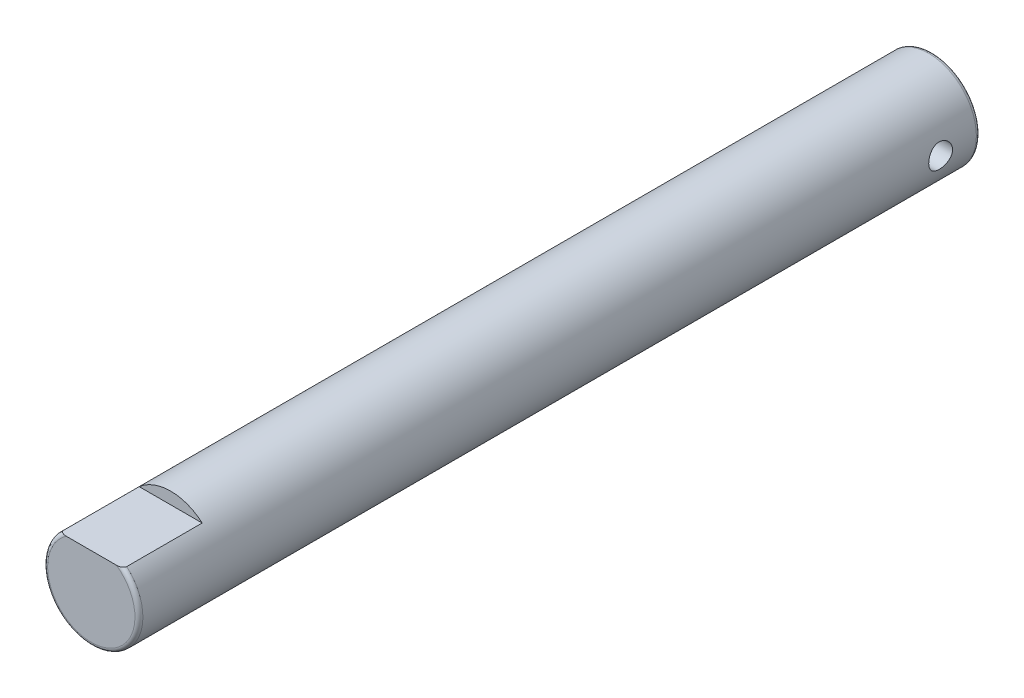
ISO-10303-21;
HEADER;
FILE_DESCRIPTION(('STEP AP214'),'2;1');
FILE_NAME('part.step','',(''),(''),'','','');
FILE_SCHEMA(('AUTOMOTIVE_DESIGN { 1 0 10303 214 1 1 1 1 }'));
ENDSEC;
DATA;
#1=APPLICATION_CONTEXT('core data for automotive mechanical design processes');
#2=APPLICATION_PROTOCOL_DEFINITION('international standard','automotive_design',2000,#1);
#3=PRODUCT_CONTEXT('',#1,'mechanical');
#4=PRODUCT('Part','Part','',(#3));
#5=PRODUCT_RELATED_PRODUCT_CATEGORY('part','',(#4));
#6=PRODUCT_DEFINITION_FORMATION('','',#4);
#7=PRODUCT_DEFINITION_CONTEXT('part definition',#1,'design');
#8=PRODUCT_DEFINITION('design','',#6,#7);
#9=PRODUCT_DEFINITION_SHAPE('','',#8);
#10=(LENGTH_UNIT() NAMED_UNIT(*) SI_UNIT(.MILLI.,.METRE.));
#11=(NAMED_UNIT(*) PLANE_ANGLE_UNIT() SI_UNIT($,.RADIAN.));
#12=(NAMED_UNIT(*) SI_UNIT($,.STERADIAN.) SOLID_ANGLE_UNIT());
#13=UNCERTAINTY_MEASURE_WITH_UNIT(LENGTH_MEASURE(1.E-05),#10,'distance_accuracy_value','');
#14=(GEOMETRIC_REPRESENTATION_CONTEXT(3) GLOBAL_UNCERTAINTY_ASSIGNED_CONTEXT((#13)) GLOBAL_UNIT_ASSIGNED_CONTEXT((#10,
#11,#12)) REPRESENTATION_CONTEXT('',''));
#15=CARTESIAN_POINT('',(0.,0.,0.));
#16=DIRECTION('',(0.,0.,1.));
#17=DIRECTION('',(1.,0.,0.));
#18=AXIS2_PLACEMENT_3D('',#15,#16,#17);
#19=CARTESIAN_POINT('',(0.,0.,53.));
#20=DIRECTION('',(0.,0.,-1.));
#21=DIRECTION('',(-1.,0.,0.));
#22=AXIS2_PLACEMENT_3D('',#19,#20,#21);
#23=CYLINDRICAL_SURFACE('',#22,3.);
#24=CARTESIAN_POINT('',(0.,0.,0.25));
#25=DIRECTION('',(0.,0.,1.));
#26=DIRECTION('',(1.,0.,0.));
#27=AXIS2_PLACEMENT_3D('',#24,#25,#26);
#28=CIRCLE('',#27,3.);
#29=CARTESIAN_POINT('',(3.,0.,0.25));
#30=VERTEX_POINT('',#29);
#31=EDGE_CURVE('E89',#30,#30,#28,.T.);
#32=ORIENTED_EDGE('',*,*,#31,.T.);
#33=EDGE_LOOP('',(#32));
#34=FACE_BOUND('',#33,.T.);
#35=CARTESIAN_POINT('',(3.,0.,1.75));
#36=CARTESIAN_POINT('',(2.99999929934006,-0.0414380443348656,1.75000116286908));
#37=CARTESIAN_POINT('',(2.99913289065914,-0.0828890789153816,1.75344577538689));
#38=CARTESIAN_POINT('',(2.99576056914946,-0.164603161885266,1.7671125756535));
#39=CARTESIAN_POINT('',(2.99325372709984,-0.20486552343537,1.77733860476892));
#40=CARTESIAN_POINT('',(2.9868781316602,-0.283010436091289,1.80421962673104));
#41=CARTESIAN_POINT('',(2.98301101421043,-0.320895781715001,1.82086689935764));
#42=CARTESIAN_POINT('',(2.97432671903797,-0.393336065952213,1.86009069502242));
#43=CARTESIAN_POINT('',(2.96950950927025,-0.42789089217438,1.88266741805947));
#44=CARTESIAN_POINT('',(2.95933706795901,-0.49340096365046,1.93360039482711));
#45=CARTESIAN_POINT('',(2.95397353574266,-0.524277845030536,1.96205578747959));
#46=CARTESIAN_POINT('',(2.94336810058765,-0.580874463601652,2.02372610245446));
#47=CARTESIAN_POINT('',(2.93812621144174,-0.606593618474567,2.05694156147325));
#48=CARTESIAN_POINT('',(2.92827387849855,-0.652513271399516,2.12779761336872));
#49=CARTESIAN_POINT('',(2.92367397235303,-0.672626107962678,2.1654966154052));
#50=CARTESIAN_POINT('',(2.91574747406112,-0.706198454275263,2.24387420582918));
#51=CARTESIAN_POINT('',(2.91242067836394,-0.719659027719666,2.28455231666288));
#52=CARTESIAN_POINT('',(2.90750238358775,-0.739277418402145,2.36687174910124));
#53=CARTESIAN_POINT('',(2.90587745537713,-0.745576134166669,2.4084774480249));
#54=CARTESIAN_POINT('',(2.9044468126887,-0.751130887533926,2.49218428450699));
#55=CARTESIAN_POINT('',(2.90464080224322,-0.750388070908989,2.53428534034931));
#56=CARTESIAN_POINT('',(2.90679602748309,-0.74199326231964,2.61670790387224));
#57=CARTESIAN_POINT('',(2.9087143150094,-0.73450917009526,2.65704781073255));
#58=CARTESIAN_POINT('',(2.91403354838242,-0.713112093451553,2.73588052545565));
#59=CARTESIAN_POINT('',(2.91743459985348,-0.699198651034712,2.77437320151449));
#60=CARTESIAN_POINT('',(2.92537556952093,-0.665194738968577,2.84886900812603));
#61=CARTESIAN_POINT('',(2.92992663734711,-0.645043333616455,2.88484308589478));
#62=CARTESIAN_POINT('',(2.93964855423193,-0.599178138007477,2.95295935487842));
#63=CARTESIAN_POINT('',(2.94481951167368,-0.57346337440442,2.98510087403363));
#64=CARTESIAN_POINT('',(2.95537940269891,-0.516331712340609,3.0456018078472));
#65=CARTESIAN_POINT('',(2.96077034738986,-0.48477312908293,3.07382724503067));
#66=CARTESIAN_POINT('',(2.97102982789393,-0.41730595875185,3.12461062123195));
#67=CARTESIAN_POINT('',(2.97589834774708,-0.381397238853972,3.14716838713178));
#68=CARTESIAN_POINT('',(2.98458866047091,-0.306057944340696,3.18602529311219));
#69=CARTESIAN_POINT('',(2.98840680063863,-0.266615696604312,3.20230267012721));
#70=CARTESIAN_POINT('',(2.99453958495709,-0.185438004071441,3.22795865285479));
#71=CARTESIAN_POINT('',(2.99685451669641,-0.143702999575243,3.23733857820907));
#72=CARTESIAN_POINT('',(2.99967749635687,-0.0602699851950138,3.24872878277942));
#73=CARTESIAN_POINT('',(3.00023026754139,-0.0185983599941053,3.25092151303765));
#74=CARTESIAN_POINT('',(2.99959402407225,0.0645164374007537,3.24837549897226));
#75=CARTESIAN_POINT('',(2.99840516620923,0.105959629822297,3.24363737860043));
#76=CARTESIAN_POINT('',(2.99444790563679,0.186807134388246,3.22751454580431));
#77=CARTESIAN_POINT('',(2.99170317092906,0.226232559484377,3.21622936826151));
#78=CARTESIAN_POINT('',(2.98494353317067,0.302628646226256,3.18744645798578));
#79=CARTESIAN_POINT('',(2.98092850184946,0.339599059516317,3.16994809784341));
#80=CARTESIAN_POINT('',(2.97196653963155,0.410761567214924,3.12888193556264));
#81=CARTESIAN_POINT('',(2.96700433683466,0.444892720917915,3.10521194380162));
#82=CARTESIAN_POINT('',(2.9567225459371,0.508763306821623,3.05260504560151));
#83=CARTESIAN_POINT('',(2.95140289625852,0.538501979486504,3.02366723019155));
#84=CARTESIAN_POINT('',(2.94084478480386,0.593495284036365,2.96049901957777));
#85=CARTESIAN_POINT('',(2.93561152093641,0.618621933811016,2.92615614849879));
#86=CARTESIAN_POINT('',(2.92596439188619,0.662755379506349,2.85363368276714));
#87=CARTESIAN_POINT('',(2.92155049033513,0.681762447078968,2.81545425852012));
#88=CARTESIAN_POINT('',(2.91409047367333,0.712975710304646,2.73654713879346));
#89=CARTESIAN_POINT('',(2.91103627645953,0.725222198327032,2.695836185828));
#90=CARTESIAN_POINT('',(2.90663372045092,0.742672829976889,2.61284518105545));
#91=CARTESIAN_POINT('',(2.90528498859968,0.747878513739329,2.57056547448376));
#92=CARTESIAN_POINT('',(2.90447450601978,0.751019295166997,2.4869394880724));
#93=CARTESIAN_POINT('',(2.90495966364132,0.749158948890059,2.44560128243763));
#94=CARTESIAN_POINT('',(2.90763954503921,0.738688639156433,2.36384805566601));
#95=CARTESIAN_POINT('',(2.90983423445928,0.730078811343384,2.32343301599317));
#96=CARTESIAN_POINT('',(2.91565630341361,0.706465659721397,2.2448957704673));
#97=CARTESIAN_POINT('',(2.91927507618155,0.691500702340188,2.2067613473799));
#98=CARTESIAN_POINT('',(2.92753877862414,0.655632456802535,2.13351730864316));
#99=CARTESIAN_POINT('',(2.93218385060387,0.634728345017094,2.09840811340654));
#100=CARTESIAN_POINT('',(2.94212817131756,0.586933874318568,2.03122268549899));
#101=CARTESIAN_POINT('',(2.94744132415879,0.559901581456127,1.99924946328802));
#102=CARTESIAN_POINT('',(2.95804013623143,0.500894685594868,1.9402264776023));
#103=CARTESIAN_POINT('',(2.9633257886353,0.468918910630573,1.91317788494352));
#104=CARTESIAN_POINT('',(2.97338827823832,0.400233793351295,1.8642943457177));
#105=CARTESIAN_POINT('',(2.97815416682934,0.363449211158193,1.84256269316421));
#106=CARTESIAN_POINT('',(2.98652462487559,0.286633029755238,1.80562626852974));
#107=CARTESIAN_POINT('',(2.99013002599891,0.24660378171837,1.79041681967573));
#108=CARTESIAN_POINT('',(2.99524029782771,0.172205126621736,1.76921408483517));
#109=CARTESIAN_POINT('',(2.99701292526345,0.138190085454035,1.76202437847328));
#110=CARTESIAN_POINT('',(2.99939302615974,0.0694530357681421,1.75241702818903));
#111=CARTESIAN_POINT('',(3.00000058725447,0.0347310806213084,1.74999902534735));
#112=CARTESIAN_POINT('',(3.,0.,1.75));
#113=B_SPLINE_CURVE_WITH_KNOTS('',3,(#35,#36,#37,#38,#39,#40,#41,#42,#43,#44,#45,#46,#47,#48,
#49,#50,#51,#52,#53,#54,#55,#56,#57,#58,#59,#60,#61,#62,#63,#64,#65,#66,#67,#68,#69,#70,#71,#72,
#73,#74,#75,#76,#77,#78,#79,#80,#81,#82,#83,#84,#85,#86,#87,#88,#89,#90,#91,#92,#93,#94,#95,#96,
#97,#98,#99,#100,#101,#102,#103,#104,#105,#106,#107,#108,#109,#110,#111,#112),.UNSPECIFIED.,.T.,
.F.,(4,2,2,2,2,2,2,2,2,2,2,2,2,2,2,2,2,2,2,2,2,2,2,2,2,2,2,2,2,2,2,2,2,2,2,2,2,2,4),(0.,
0.124186856235945,0.24844411888195,0.372552451143053,0.496664970084664,0.623072177185695,
0.749493647900309,0.877793237729034,1.00607230584684,1.13178147549715,1.25747019056348,
1.38011248503509,1.50276351733019,1.62665263936939,1.75056345418081,1.87800750484509,
2.00545544779123,2.13334114504557,2.26120236844321,2.38579154474638,2.51036950556371,
2.63310137257019,2.75584563661145,2.88076793782676,3.00571181504009,3.13372254602238,
3.26172759374754,3.38896127307018,3.51616711626204,3.63971890199306,3.76326820478017,
3.88608200279723,4.0089128406845,4.13494788204955,4.26101284885209,4.38936092749794,
4.51761681910675,4.62171121471074,4.7257977802152),.UNSPECIFIED.);
#114=CARTESIAN_POINT('',(3.,0.,1.75));
#115=VERTEX_POINT('',#114);
#116=EDGE_CURVE('E98',#115,#115,#113,.T.);
#117=ORIENTED_EDGE('',*,*,#116,.T.);
#118=EDGE_LOOP('',(#117));
#119=FACE_BOUND('',#118,.T.);
#120=CARTESIAN_POINT('',(-3.,0.,1.75));
#121=CARTESIAN_POINT('',(-2.99999929934006,0.0414380443348655,1.75000116286908));
#122=CARTESIAN_POINT('',(-2.99913289065914,0.0828890789153816,1.75344577538689));
#123=CARTESIAN_POINT('',(-2.99576056914946,0.164603161885266,1.7671125756535));
#124=CARTESIAN_POINT('',(-2.99325372709984,0.20486552343537,1.77733860476892));
#125=CARTESIAN_POINT('',(-2.9868781316602,0.283010436091288,1.80421962673104));
#126=CARTESIAN_POINT('',(-2.98301101421043,0.320895781715001,1.82086689935764));
#127=CARTESIAN_POINT('',(-2.97432671903797,0.393336065952213,1.86009069502242));
#128=CARTESIAN_POINT('',(-2.96950950927025,0.427890892174379,1.88266741805947));
#129=CARTESIAN_POINT('',(-2.95933706795901,0.49340096365046,1.93360039482711));
#130=CARTESIAN_POINT('',(-2.95397353574266,0.524277845030536,1.96205578747959));
#131=CARTESIAN_POINT('',(-2.94336810058765,0.580874463601652,2.02372610245446));
#132=CARTESIAN_POINT('',(-2.93812621144174,0.606593618474567,2.05694156147325));
#133=CARTESIAN_POINT('',(-2.92827387849855,0.652513271399516,2.12779761336872));
#134=CARTESIAN_POINT('',(-2.92367397235303,0.672626107962678,2.1654966154052));
#135=CARTESIAN_POINT('',(-2.91574747406112,0.706198454275264,2.24387420582918));
#136=CARTESIAN_POINT('',(-2.91242067836394,0.719659027719666,2.28455231666288));
#137=CARTESIAN_POINT('',(-2.90750238358775,0.739277418402145,2.36687174910124));
#138=CARTESIAN_POINT('',(-2.90587745537713,0.745576134166669,2.4084774480249));
#139=CARTESIAN_POINT('',(-2.9044468126887,0.751130887533926,2.49218428450699));
#140=CARTESIAN_POINT('',(-2.90464080224322,0.750388070908989,2.53428534034931));
#141=CARTESIAN_POINT('',(-2.90679602748309,0.74199326231964,2.61670790387224));
#142=CARTESIAN_POINT('',(-2.9087143150094,0.73450917009526,2.65704781073255));
#143=CARTESIAN_POINT('',(-2.91403354838242,0.713112093451553,2.73588052545565));
#144=CARTESIAN_POINT('',(-2.91743459985348,0.699198651034711,2.77437320151449));
#145=CARTESIAN_POINT('',(-2.92537556952093,0.665194738968577,2.84886900812603));
#146=CARTESIAN_POINT('',(-2.92992663734711,0.645043333616455,2.88484308589478));
#147=CARTESIAN_POINT('',(-2.93964855423193,0.599178138007477,2.95295935487842));
#148=CARTESIAN_POINT('',(-2.94481951167368,0.57346337440442,2.98510087403363));
#149=CARTESIAN_POINT('',(-2.95537940269891,0.516331712340609,3.0456018078472));
#150=CARTESIAN_POINT('',(-2.96077034738986,0.48477312908293,3.07382724503067));
#151=CARTESIAN_POINT('',(-2.97102982789393,0.41730595875185,3.12461062123195));
#152=CARTESIAN_POINT('',(-2.97589834774708,0.381397238853972,3.14716838713178));
#153=CARTESIAN_POINT('',(-2.98458866047091,0.306057944340696,3.18602529311219));
#154=CARTESIAN_POINT('',(-2.98840680063863,0.266615696604312,3.20230267012721));
#155=CARTESIAN_POINT('',(-2.99453958495709,0.185438004071441,3.22795865285479));
#156=CARTESIAN_POINT('',(-2.99685451669641,0.143702999575242,3.23733857820907));
#157=CARTESIAN_POINT('',(-2.99967749635687,0.0602699851950137,3.24872878277942));
#158=CARTESIAN_POINT('',(-3.00023026754139,0.0185983599941052,3.25092151303765));
#159=CARTESIAN_POINT('',(-2.99959402407225,-0.0645164374007537,3.24837549897226));
#160=CARTESIAN_POINT('',(-2.99840516620923,-0.105959629822297,3.24363737860043));
#161=CARTESIAN_POINT('',(-2.99444790563679,-0.186807134388246,3.22751454580431));
#162=CARTESIAN_POINT('',(-2.99170317092906,-0.226232559484377,3.21622936826151));
#163=CARTESIAN_POINT('',(-2.98494353317067,-0.302628646226255,3.18744645798578));
#164=CARTESIAN_POINT('',(-2.98092850184946,-0.339599059516317,3.16994809784341));
#165=CARTESIAN_POINT('',(-2.97196653963155,-0.410761567214923,3.12888193556264));
#166=CARTESIAN_POINT('',(-2.96700433683466,-0.444892720917915,3.10521194380162));
#167=CARTESIAN_POINT('',(-2.9567225459371,-0.508763306821622,3.05260504560152));
#168=CARTESIAN_POINT('',(-2.95140289625852,-0.538501979486503,3.02366723019155));
#169=CARTESIAN_POINT('',(-2.94084478480386,-0.593495284036365,2.96049901957777));
#170=CARTESIAN_POINT('',(-2.93561152093641,-0.618621933811016,2.92615614849879));
#171=CARTESIAN_POINT('',(-2.92596439188619,-0.662755379506349,2.85363368276714));
#172=CARTESIAN_POINT('',(-2.92155049033513,-0.681762447078968,2.81545425852012));
#173=CARTESIAN_POINT('',(-2.91409047367333,-0.712975710304646,2.73654713879346));
#174=CARTESIAN_POINT('',(-2.91103627645953,-0.725222198327032,2.695836185828));
#175=CARTESIAN_POINT('',(-2.90663372045092,-0.742672829976889,2.61284518105545));
#176=CARTESIAN_POINT('',(-2.90528498859968,-0.747878513739329,2.57056547448376));
#177=CARTESIAN_POINT('',(-2.90447450601978,-0.751019295166997,2.4869394880724));
#178=CARTESIAN_POINT('',(-2.90495966364132,-0.749158948890059,2.44560128243763));
#179=CARTESIAN_POINT('',(-2.90763954503921,-0.738688639156433,2.36384805566601));
#180=CARTESIAN_POINT('',(-2.90983423445928,-0.730078811343384,2.32343301599317));
#181=CARTESIAN_POINT('',(-2.91565630341361,-0.706465659721397,2.2448957704673));
#182=CARTESIAN_POINT('',(-2.91927507618155,-0.691500702340188,2.2067613473799));
#183=CARTESIAN_POINT('',(-2.92753877862414,-0.655632456802535,2.13351730864316));
#184=CARTESIAN_POINT('',(-2.93218385060387,-0.634728345017094,2.09840811340654));
#185=CARTESIAN_POINT('',(-2.94212817131756,-0.586933874318568,2.03122268549899));
#186=CARTESIAN_POINT('',(-2.94744132415879,-0.559901581456127,1.99924946328802));
#187=CARTESIAN_POINT('',(-2.95804013623143,-0.500894685594868,1.9402264776023));
#188=CARTESIAN_POINT('',(-2.9633257886353,-0.468918910630573,1.91317788494352));
#189=CARTESIAN_POINT('',(-2.97338827823831,-0.400233793351295,1.8642943457177));
#190=CARTESIAN_POINT('',(-2.97815416682934,-0.363449211158194,1.84256269316421));
#191=CARTESIAN_POINT('',(-2.98652462487559,-0.286633029755238,1.80562626852974));
#192=CARTESIAN_POINT('',(-2.99013002599891,-0.24660378171837,1.79041681967573));
#193=CARTESIAN_POINT('',(-2.99524029782771,-0.172205126621736,1.76921408483517));
#194=CARTESIAN_POINT('',(-2.99701292526345,-0.138190085454034,1.76202437847328));
#195=CARTESIAN_POINT('',(-2.99939302615974,-0.0694530357681416,1.75241702818903));
#196=CARTESIAN_POINT('',(-3.00000058725447,-0.0347310806213081,1.74999902534735));
#197=CARTESIAN_POINT('',(-3.,0.,1.75));
#198=B_SPLINE_CURVE_WITH_KNOTS('',3,(#120,#121,#122,#123,#124,#125,#126,#127,#128,#129,#130,
#131,#132,#133,#134,#135,#136,#137,#138,#139,#140,#141,#142,#143,#144,#145,#146,#147,#148,#149,
#150,#151,#152,#153,#154,#155,#156,#157,#158,#159,#160,#161,#162,#163,#164,#165,#166,#167,#168,
#169,#170,#171,#172,#173,#174,#175,#176,#177,#178,#179,#180,#181,#182,#183,#184,#185,#186,#187,
#188,#189,#190,#191,#192,#193,#194,#195,#196,#197),.UNSPECIFIED.,.T.,.F.,(4,2,2,2,2,2,2,2,2,2,2,
2,2,2,2,2,2,2,2,2,2,2,2,2,2,2,2,2,2,2,2,2,2,2,2,2,2,2,4),(0.,0.124186856235945,0.24844411888195,
0.372552451143053,0.496664970084664,0.623072177185695,0.749493647900309,0.877793237729034,
1.00607230584684,1.13178147549715,1.25747019056348,1.38011248503509,1.50276351733019,
1.62665263936939,1.75056345418081,1.8780075048451,2.00545544779123,2.13334114504557,
2.26120236844321,2.38579154474638,2.51036950556371,2.63310137257019,2.75584563661145,
2.88076793782676,3.00571181504009,3.13372254602238,3.26172759374754,3.38896127307018,
3.51616711626204,3.63971890199306,3.76326820478017,3.88608200279723,4.0089128406845,
4.13494788204955,4.26101284885209,4.38936092749794,4.51761681910675,4.62171121471074,
4.7257977802152),.UNSPECIFIED.);
#199=CARTESIAN_POINT('',(-3.,0.,1.75));
#200=VERTEX_POINT('',#199);
#201=EDGE_CURVE('E106',#200,#200,#198,.T.);
#202=ORIENTED_EDGE('',*,*,#201,.T.);
#203=EDGE_LOOP('',(#202));
#204=FACE_BOUND('',#203,.T.);
#205=DIRECTION('',(0.,0.,-1.));
#206=VECTOR('',#205,1.);
#207=CARTESIAN_POINT('',(1.98431348329844,2.25,53.));
#208=LINE('',#207,#206);
#209=CARTESIAN_POINT('',(1.98431348329858,2.25,52.7500000000001));
#210=VERTEX_POINT('',#209);
#211=CARTESIAN_POINT('',(1.98431348329844,2.25,48.));
#212=VERTEX_POINT('',#211);
#213=EDGE_CURVE('E74',#210,#212,#208,.T.);
#214=ORIENTED_EDGE('',*,*,#213,.F.);
#215=CARTESIAN_POINT('',(0.,0.,52.75));
#216=DIRECTION('',(0.,0.,1.));
#217=DIRECTION('',(1.,0.,0.));
#218=AXIS2_PLACEMENT_3D('',#215,#216,#217);
#219=CIRCLE('',#218,3.);
#220=CARTESIAN_POINT('',(-1.98431348329844,2.25,52.75));
#221=VERTEX_POINT('',#220);
#222=EDGE_CURVE('E87',#210,#221,#219,.F.);
#223=ORIENTED_EDGE('',*,*,#222,.T.);
#224=DIRECTION('',(0.,0.,-1.));
#225=VECTOR('',#224,1.);
#226=CARTESIAN_POINT('',(-1.98431348329844,2.25,53.));
#227=LINE('',#226,#225);
#228=CARTESIAN_POINT('',(-1.98431348329844,2.25,48.));
#229=VERTEX_POINT('',#228);
#230=EDGE_CURVE('E60',#229,#221,#227,.F.);
#231=ORIENTED_EDGE('',*,*,#230,.F.);
#232=CARTESIAN_POINT('',(0.,0.,48.));
#233=DIRECTION('',(0.,0.,1.));
#234=DIRECTION('',(1.,0.,0.));
#235=AXIS2_PLACEMENT_3D('',#232,#233,#234);
#236=CIRCLE('',#235,3.);
#237=EDGE_CURVE('E11',#212,#229,#236,.T.);
#238=ORIENTED_EDGE('',*,*,#237,.F.);
#239=EDGE_LOOP('',(#214,#223,#231,#238));
#240=FACE_BOUND('',#239,.T.);
#241=ADVANCED_FACE('F38',(#34,#119,#204,#240),#23,.T.);
#242=CARTESIAN_POINT('',(0.,0.,53.));
#243=DIRECTION('',(0.,0.,1.));
#244=DIRECTION('',(1.,0.,0.));
#245=AXIS2_PLACEMENT_3D('',#242,#243,#244);
#246=PLANE('',#245);
#247=CARTESIAN_POINT('',(0.,0.,53.));
#248=DIRECTION('',(0.,0.,1.));
#249=DIRECTION('',(1.,0.,0.));
#250=AXIS2_PLACEMENT_3D('',#247,#248,#249);
#251=CIRCLE('',#250,2.75);
#252=CARTESIAN_POINT('',(-1.58113883008419,2.25,53.));
#253=VERTEX_POINT('',#252);
#254=CARTESIAN_POINT('',(1.58113883008419,2.25,53.));
#255=VERTEX_POINT('',#254);
#256=EDGE_CURVE('E95',#253,#255,#251,.T.);
#257=ORIENTED_EDGE('',*,*,#256,.T.);
#258=DIRECTION('',(1.,0.,0.));
#259=VECTOR('',#258,1.);
#260=CARTESIAN_POINT('',(-6.70116993974275,2.25,53.));
#261=LINE('',#260,#259);
#262=EDGE_CURVE('E54',#253,#255,#261,.T.);
#263=ORIENTED_EDGE('',*,*,#262,.F.);
#264=EDGE_LOOP('',(#257,#263));
#265=FACE_BOUND('',#264,.T.);
#266=ADVANCED_FACE('F121',(#265),#246,.T.);
#267=CARTESIAN_POINT('',(0.,0.,52.75));
#268=DIRECTION('',(0.,0.,1.));
#269=DIRECTION('',(1.,0.,0.));
#270=AXIS2_PLACEMENT_3D('',#267,#268,#269);
#271=TOROIDAL_SURFACE('',#270,2.75,0.25);
#272=ORIENTED_EDGE('',*,*,#256,.F.);
#273=CARTESIAN_POINT('',(-1.9718113139557,2.25,52.8137119813873));
#274=CARTESIAN_POINT('',(-1.97540898736044,2.25,52.8047150499053));
#275=CARTESIAN_POINT('',(-1.97829682896623,2.25,52.7954323368871));
#276=CARTESIAN_POINT('',(-1.98245979339104,2.25,52.7765104740211));
#277=CARTESIAN_POINT('',(-1.98373572190047,2.25,52.7668715047244));
#278=CARTESIAN_POINT('',(-1.98457891130507,2.25,52.7475000701544));
#279=CARTESIAN_POINT('',(-1.98414298147575,2.25,52.7377674640503));
#280=CARTESIAN_POINT('',(-1.98158985718113,2.25,52.7185263564775));
#281=CARTESIAN_POINT('',(-1.97947223486214,2.25,52.7090179126737));
#282=CARTESIAN_POINT('',(-1.97378599827373,2.25,52.6907258359995));
#283=CARTESIAN_POINT('',(-1.97025684930185,2.25,52.6819297406843));
#284=CARTESIAN_POINT('',(-1.9619566165591,2.25,52.6649501586273));
#285=CARTESIAN_POINT('',(-1.95718505673315,2.25,52.6567669082604));
#286=CARTESIAN_POINT('',(-1.94412010360404,2.25,52.6373985702391));
#287=CARTESIAN_POINT('',(-1.9352269792281,2.25,52.6266175325243));
#288=CARTESIAN_POINT('',(-1.91582933635676,2.25,52.6066177339158));
#289=CARTESIAN_POINT('',(-1.90532103970148,2.25,52.5974027455386));
#290=CARTESIAN_POINT('',(-1.87796414899081,2.25,52.5764866545752));
#291=CARTESIAN_POINT('',(-1.86045623431595,2.25,52.5656515104181));
#292=CARTESIAN_POINT('',(-1.82399897337511,2.25,52.5468190220228));
#293=CARTESIAN_POINT('',(-1.80504727584056,2.25,52.5388264323867));
#294=CARTESIAN_POINT('',(-1.75533768654223,2.25,52.5214573652458));
#295=CARTESIAN_POINT('',(-1.72396303021499,2.25,52.5138535119882));
#296=CARTESIAN_POINT('',(-1.66041031958156,2.25,52.5035119844827));
#297=CARTESIAN_POINT('',(-1.62823013029133,2.25,52.5007890344281));
#298=CARTESIAN_POINT('',(-1.55089469427919,2.25,52.4992484383214));
#299=CARTESIAN_POINT('',(-1.50570090241571,2.25,52.5024298467248));
#300=CARTESIAN_POINT('',(-1.41649529089171,2.25,52.5159834155936));
#301=CARTESIAN_POINT('',(-1.37248111669853,2.25,52.5263399391221));
#302=CARTESIAN_POINT('',(-1.31004696242144,2.25,52.5470433338235));
#303=CARTESIAN_POINT('',(-1.29061157338874,2.25,52.554390286424));
#304=CARTESIAN_POINT('',(-1.25250756733149,2.25,52.5709523179978));
#305=CARTESIAN_POINT('',(-1.23383963720717,2.25,52.5801690284922));
#306=CARTESIAN_POINT('',(-1.20057880602798,2.25,52.5992561084164));
#307=CARTESIAN_POINT('',(-1.18580238402326,2.25,52.6088045273668));
#308=CARTESIAN_POINT('',(-1.15777630879559,2.25,52.6299247844463));
#309=CARTESIAN_POINT('',(-1.14452027360521,2.25,52.6414876096883));
#310=CARTESIAN_POINT('',(-1.12721695796791,2.25,52.6602882971038));
#311=CARTESIAN_POINT('',(-1.12205856144689,2.25,52.6664960751935));
#312=CARTESIAN_POINT('',(-1.11257062380342,2.25,52.6795320360797));
#313=CARTESIAN_POINT('',(-1.10824136710899,2.25,52.6863604305922));
#314=CARTESIAN_POINT('',(-1.10067158561116,2.25,52.7007403631832));
#315=CARTESIAN_POINT('',(-1.09744777811995,2.25,52.7083009600248));
#316=CARTESIAN_POINT('',(-1.09257240356192,2.25,52.7239096807801));
#317=CARTESIAN_POINT('',(-1.09091625286343,2.25,52.7319563097428));
#318=CARTESIAN_POINT('',(-1.08953604528084,2.25,52.7471103201824));
#319=CARTESIAN_POINT('',(-1.08957977077728,2.25,52.7541965371373));
#320=CARTESIAN_POINT('',(-1.09102398961312,2.25,52.7682310598516));
#321=CARTESIAN_POINT('',(-1.0924256602307,2.25,52.7751792406055));
#322=CARTESIAN_POINT('',(-1.09664485148977,2.25,52.7895062440812));
#323=CARTESIAN_POINT('',(-1.09960811285791,2.25,52.7968411324299));
#324=CARTESIAN_POINT('',(-1.10667367901796,2.25,52.8109362306138));
#325=CARTESIAN_POINT('',(-1.11077800178433,2.25,52.8176953943528));
#326=CARTESIAN_POINT('',(-1.12254892848088,2.25,52.8345299905722));
#327=CARTESIAN_POINT('',(-1.13086983316322,2.25,52.8441426175522));
#328=CARTESIAN_POINT('',(-1.1488119746846,2.25,52.8620537479466));
#329=CARTESIAN_POINT('',(-1.15843682757064,2.25,52.8703484524035));
#330=CARTESIAN_POINT('',(-1.18818108082011,2.25,52.8933371795118));
#331=CARTESIAN_POINT('',(-1.20947611283059,2.25,52.9064957472401));
#332=CARTESIAN_POINT('',(-1.25363556357334,2.25,52.9298097156737));
#333=CARTESIAN_POINT('',(-1.27650461083595,2.25,52.9399557485899));
#334=CARTESIAN_POINT('',(-1.32040979499779,2.25,52.9566879459718));
#335=CARTESIAN_POINT('',(-1.34133987336902,2.25,52.9635541601701));
#336=CARTESIAN_POINT('',(-1.38370535559015,2.25,52.9755093436252));
#337=CARTESIAN_POINT('',(-1.40514112315122,2.25,52.9805969893194));
#338=CARTESIAN_POINT('',(-1.4699549061405,2.25,52.9932819249341));
#339=CARTESIAN_POINT('',(-1.51387609397761,2.25,52.9983146609122));
#340=CARTESIAN_POINT('',(-1.59158199557355,2.25,53.0006649690444));
#341=CARTESIAN_POINT('',(-1.62532926155243,2.25,52.9995145931942));
#342=CARTESIAN_POINT('',(-1.69226507138207,2.25,52.9921817605356));
#343=CARTESIAN_POINT('',(-1.72545492420914,2.25,52.9860135273122));
#344=CARTESIAN_POINT('',(-1.77730556008162,2.25,52.9711999178748));
#345=CARTESIAN_POINT('',(-1.79652271150594,2.25,52.9644980298989));
#346=CARTESIAN_POINT('',(-1.83386579612859,2.25,52.9484958284102));
#347=CARTESIAN_POINT('',(-1.8519927651645,2.25,52.9391980303717));
#348=CARTESIAN_POINT('',(-1.88192307969921,2.25,52.9204234058196));
#349=CARTESIAN_POINT('',(-1.8941462184002,2.25,52.9116199842411));
#350=CARTESIAN_POINT('',(-1.9170972417617,2.25,52.8922317010518));
#351=CARTESIAN_POINT('',(-1.92782760033459,2.25,52.881649852604));
#352=CARTESIAN_POINT('',(-1.94459533150765,2.25,52.8616875534848));
#353=CARTESIAN_POINT('',(-1.95112493215495,2.25,52.8527222395417));
#354=CARTESIAN_POINT('',(-1.96268021702041,2.25,52.8338651999799));
#355=CARTESIAN_POINT('',(-1.96770755639369,2.25,52.8239745098191));
#356=CARTESIAN_POINT('',(-1.9718113139557,2.25,52.8137119813873));
#357=B_SPLINE_CURVE_WITH_KNOTS('',3,(#273,#274,#275,#276,#277,#278,#279,#280,#281,#282,#283,
#284,#285,#286,#287,#288,#289,#290,#291,#292,#293,#294,#295,#296,#297,#298,#299,#300,#301,#302,
#303,#304,#305,#306,#307,#308,#309,#310,#311,#312,#313,#314,#315,#316,#317,#318,#319,#320,#321,
#322,#323,#324,#325,#326,#327,#328,#329,#330,#331,#332,#333,#334,#335,#336,#337,#338,#339,#340,
#341,#342,#343,#344,#345,#346,#347,#348,#349,#350,#351,#352,#353,#354,#355,#356),.UNSPECIFIED.,
.T.,.F.,(4,2,2,2,2,2,2,2,2,2,2,2,2,2,2,2,2,2,2,2,2,2,2,2,2,2,2,2,2,2,2,2,2,2,2,2,2,2,2,2,2,4),
(0.,0.0290357225937096,0.0580569263705352,0.0871322482802994,0.116214969860783,0.14453580442707,
0.172867506709472,0.214558684656927,0.256348912672604,0.317772704376498,0.379298758737188,
0.475611853969226,0.572215010497378,0.707479448885727,0.842450025047232,0.904715837056304,
0.967036216752718,1.01971111346477,1.07215611590087,1.09632040855716,1.12049297573967,
1.14501645268681,1.16946800254021,1.1905927383516,1.21173580477579,1.23533850693618,
1.25898321910316,1.29690924350706,1.33494268173122,1.40962513234504,1.48453744042796,
1.55052841677081,1.61656839779868,1.74853237346781,1.84956071563374,1.95030367728341,
2.01121729404563,2.07207208828463,2.11712496171615,2.16210225834206,2.19525909876238,
2.22837927192903),.UNSPECIFIED.);
#358=EDGE_CURVE('E47',#253,#221,#357,.T.);
#359=ORIENTED_EDGE('',*,*,#358,.T.);
#360=ORIENTED_EDGE('',*,*,#222,.F.);
#361=CARTESIAN_POINT('',(1.09574558678004,2.25,52.7138305543206));
#362=CARTESIAN_POINT('',(1.09872789783989,2.25,52.7049057348342));
#363=CARTESIAN_POINT('',(1.10272559047061,2.25,52.6963044290045));
#364=CARTESIAN_POINT('',(1.11218818053896,2.25,52.6799297215934));
#365=CARTESIAN_POINT('',(1.11766242573409,2.25,52.6721620514032));
#366=CARTESIAN_POINT('',(1.13289820177776,2.25,52.6533798117462));
#367=CARTESIAN_POINT('',(1.14335847710578,2.25,52.6429392259651));
#368=CARTESIAN_POINT('',(1.1656331090303,2.25,52.6236769371493));
#369=CARTESIAN_POINT('',(1.17744925435644,2.25,52.6148574135253));
#370=CARTESIAN_POINT('',(1.21412132471381,2.25,52.5903399481944));
#371=CARTESIAN_POINT('',(1.2402399786343,2.25,52.576543353298));
#372=CARTESIAN_POINT('',(1.29411319279795,2.25,52.5526504261227));
#373=CARTESIAN_POINT('',(1.32187311677105,2.25,52.5425671041248));
#374=CARTESIAN_POINT('',(1.39371200288926,2.25,52.5209819396276));
#375=CARTESIAN_POINT('',(1.4384644345557,2.25,52.5116848154667));
#376=CARTESIAN_POINT('',(1.52884097693359,2.25,52.5005067061241));
#377=CARTESIAN_POINT('',(1.5744636997056,2.25,52.4986147666814));
#378=CARTESIAN_POINT('',(1.64831782735279,2.25,52.5025107256043));
#379=CARTESIAN_POINT('',(1.67668911292163,2.25,52.5056974048063));
#380=CARTESIAN_POINT('',(1.73271546471799,2.25,52.5160049446985));
#381=CARTESIAN_POINT('',(1.7603717271672,2.25,52.5231187202843));
#382=CARTESIAN_POINT('',(1.80551417417473,2.25,52.5390608592444));
#383=CARTESIAN_POINT('',(1.8234433210471,2.25,52.5466293196656));
#384=CARTESIAN_POINT('',(1.85802129609649,2.25,52.5643046641285));
#385=CARTESIAN_POINT('',(1.8746719371958,2.25,52.5744078637233));
#386=CARTESIAN_POINT('',(1.90125519588908,2.25,52.5940707169763));
#387=CARTESIAN_POINT('',(1.9117190488953,2.25,52.60290877039));
#388=CARTESIAN_POINT('',(1.93116881785341,2.25,52.6220920686667));
#389=CARTESIAN_POINT('',(1.94015692659245,2.25,52.6324350334665));
#390=CARTESIAN_POINT('',(1.9543794154494,2.25,52.6522100604064));
#391=CARTESIAN_POINT('',(1.9600053398392,2.25,52.6613588651227));
#392=CARTESIAN_POINT('',(1.96968754919696,2.25,52.680458990862));
#393=CARTESIAN_POINT('',(1.973744854535,2.25,52.6904097850905));
#394=CARTESIAN_POINT('',(1.98001639867395,2.25,52.7109702644483));
#395=CARTESIAN_POINT('',(1.98221617274108,2.25,52.7215844416926));
#396=CARTESIAN_POINT('',(1.98451593639286,2.25,52.7430377075664));
#397=CARTESIAN_POINT('',(1.98461715120759,2.25,52.7538766612608));
#398=CARTESIAN_POINT('',(1.98283264739395,2.25,52.7740448445928));
#399=CARTESIAN_POINT('',(1.9811883893566,2.25,52.783396608087));
#400=CARTESIAN_POINT('',(1.9764002375216,2.25,52.801704704108));
#401=CARTESIAN_POINT('',(1.97325612280083,2.25,52.8106609781683));
#402=CARTESIAN_POINT('',(1.96553559467011,2.25,52.828280043702));
#403=CARTESIAN_POINT('',(1.96091536004948,2.25,52.8369234118186));
#404=CARTESIAN_POINT('',(1.95052220318371,2.25,52.8534806377611));
#405=CARTESIAN_POINT('',(1.94474871600063,2.25,52.861394135261));
#406=CARTESIAN_POINT('',(1.92863565656535,2.25,52.8808414869532));
#407=CARTESIAN_POINT('',(1.91759623559274,2.25,52.8917967278921));
#408=CARTESIAN_POINT('',(1.89392152423935,2.25,52.9118231436635));
#409=CARTESIAN_POINT('',(1.88128203564842,2.25,52.9208891897937));
#410=CARTESIAN_POINT('',(1.84822201577409,2.25,52.9414602926842));
#411=CARTESIAN_POINT('',(1.82711538830901,2.25,52.951858228309));
#412=CARTESIAN_POINT('',(1.78358348439801,2.25,52.9692937627277));
#413=CARTESIAN_POINT('',(1.76115600257482,2.25,52.9763255516817));
#414=CARTESIAN_POINT('',(1.70285325563344,2.25,52.9906718380481));
#415=CARTESIAN_POINT('',(1.66647677647344,2.25,52.9959418999972));
#416=CARTESIAN_POINT('',(1.59333891238797,2.25,53.0008381114781));
#417=CARTESIAN_POINT('',(1.55657678062724,2.25,53.0004497816699));
#418=CARTESIAN_POINT('',(1.48164393940762,2.25,52.9945732666355));
#419=CARTESIAN_POINT('',(1.44349305050597,2.25,52.988834800185));
#420=CARTESIAN_POINT('',(1.36848041588698,2.25,52.9721359078271));
#421=CARTESIAN_POINT('',(1.33161481149753,2.25,52.9611928781722));
#422=CARTESIAN_POINT('',(1.26622834032781,2.25,52.9358185983443));
#423=CARTESIAN_POINT('',(1.23736588749099,2.25,52.9223161806227));
#424=CARTESIAN_POINT('',(1.19631394490309,2.25,52.8979849806662));
#425=CARTESIAN_POINT('',(1.18295071746792,2.25,52.8891477843932));
#426=CARTESIAN_POINT('',(1.15752076780908,2.25,52.8697677316748));
#427=CARTESIAN_POINT('',(1.14545008220347,2.25,52.8592303531645));
#428=CARTESIAN_POINT('',(1.12904581166428,2.25,52.8418093123738));
#429=CARTESIAN_POINT('',(1.1238606875422,2.25,52.8357320876283));
#430=CARTESIAN_POINT('',(1.11427127054952,2.25,52.822975333734));
#431=CARTESIAN_POINT('',(1.10986718479338,2.25,52.8162956455313));
#432=CARTESIAN_POINT('',(1.10208287830907,2.25,52.8022323372348));
#433=CARTESIAN_POINT('',(1.09871700535125,2.25,52.7948405588816));
#434=CARTESIAN_POINT('',(1.09346759819583,2.25,52.7795454530236));
#435=CARTESIAN_POINT('',(1.09158088240287,2.25,52.7716432632664));
#436=CARTESIAN_POINT('',(1.08967968053804,2.25,52.7564597445972));
#437=CARTESIAN_POINT('',(1.08948889291015,2.25,52.7492007129039));
#438=CARTESIAN_POINT('',(1.09054812620694,2.25,52.7347971608622));
#439=CARTESIAN_POINT('',(1.09179597257328,2.25,52.7276524841933));
#440=CARTESIAN_POINT('',(1.09429592995178,2.25,52.7183857341949));
#441=CARTESIAN_POINT('',(1.09498799703161,2.25,52.7160977060744));
#442=CARTESIAN_POINT('',(1.09574558678004,2.25,52.7138305543206));
#443=B_SPLINE_CURVE_WITH_KNOTS('',3,(#361,#362,#363,#364,#365,#366,#367,#368,#369,#370,#371,
#372,#373,#374,#375,#376,#377,#378,#379,#380,#381,#382,#383,#384,#385,#386,#387,#388,#389,#390,
#391,#392,#393,#394,#395,#396,#397,#398,#399,#400,#401,#402,#403,#404,#405,#406,#407,#408,#409,
#410,#411,#412,#413,#414,#415,#416,#417,#418,#419,#420,#421,#422,#423,#424,#425,#426,#427,#428,
#429,#430,#431,#432,#433,#434,#435,#436,#437,#438,#439,#440,#441,#442),.UNSPECIFIED.,.T.,.F.,(4,
2,2,2,2,2,2,2,2,2,2,2,2,2,2,2,2,2,2,2,2,2,2,2,2,2,2,2,2,2,2,2,2,2,2,2,2,2,2,2,4),(0.,
0.0282244440804397,0.0566319447828036,0.100717356834347,0.144861612064056,0.232986519909581,
0.321417319758994,0.457883829922636,0.594148392928532,0.679589245433322,0.764876450506546,
0.823106758033161,0.881252908627149,0.922216827212764,0.963119316197194,0.995216237719208,
1.02729224526288,1.05961578618951,1.09192045469682,1.12027471449845,1.14863315206372,
1.177926938688,1.20723511065799,1.25362770128755,1.30014464125845,1.37033690358555,
1.44064988212009,1.5503157414352,1.66026227547043,1.77562487671706,1.89060455976005,
1.98572665457255,2.03370460048013,2.0815309414098,2.10545140166816,2.12937819566075,
2.15362219517864,2.17781390285264,2.1994569796532,2.22106738483847,2.22823717667485),.UNSPECIFIED.);
#444=EDGE_CURVE('E80',#210,#255,#443,.T.);
#445=ORIENTED_EDGE('',*,*,#444,.T.);
#446=EDGE_LOOP('',(#272,#359,#360,#445));
#447=FACE_BOUND('',#446,.T.);
#448=ADVANCED_FACE('F40',(#447),#271,.T.);
#449=CARTESIAN_POINT('',(0.,0.,0.));
#450=DIRECTION('',(0.,0.,1.));
#451=DIRECTION('',(1.,0.,0.));
#452=AXIS2_PLACEMENT_3D('',#449,#450,#451);
#453=PLANE('',#452);
#454=CARTESIAN_POINT('',(0.,0.,0.));
#455=DIRECTION('',(0.,0.,1.));
#456=DIRECTION('',(1.,0.,0.));
#457=AXIS2_PLACEMENT_3D('',#454,#455,#456);
#458=CIRCLE('',#457,2.75);
#459=CARTESIAN_POINT('',(2.75,0.,0.));
#460=VERTEX_POINT('',#459);
#461=EDGE_CURVE('E92',#460,#460,#458,.F.);
#462=ORIENTED_EDGE('',*,*,#461,.T.);
#463=EDGE_LOOP('',(#462));
#464=FACE_BOUND('',#463,.T.);
#465=ADVANCED_FACE('F125',(#464),#453,.F.);
#466=CARTESIAN_POINT('',(0.,0.,0.25));
#467=DIRECTION('',(0.,0.,1.));
#468=DIRECTION('',(1.,0.,0.));
#469=AXIS2_PLACEMENT_3D('',#466,#467,#468);
#470=TOROIDAL_SURFACE('',#469,2.75,0.25);
#471=ORIENTED_EDGE('',*,*,#461,.F.);
#472=EDGE_LOOP('',(#471));
#473=FACE_BOUND('',#472,.T.);
#474=ORIENTED_EDGE('',*,*,#31,.F.);
#475=EDGE_LOOP('',(#474));
#476=FACE_BOUND('',#475,.T.);
#477=ADVANCED_FACE('F118',(#473,#476),#470,.T.);
#478=CARTESIAN_POINT('',(-3.,0.,2.5));
#479=DIRECTION('',(1.,0.,0.));
#480=DIRECTION('',(0.,0.,-1.));
#481=AXIS2_PLACEMENT_3D('',#478,#479,#480);
#482=CYLINDRICAL_SURFACE('',#481,0.75);
#483=ORIENTED_EDGE('',*,*,#116,.F.);
#484=EDGE_LOOP('',(#483));
#485=FACE_BOUND('',#484,.T.);
#486=ORIENTED_EDGE('',*,*,#201,.F.);
#487=EDGE_LOOP('',(#486));
#488=FACE_BOUND('',#487,.T.);
#489=ADVANCED_FACE('F113',(#485,#488),#482,.F.);
#490=CARTESIAN_POINT('',(-6.70116993974275,3.,48.));
#491=DIRECTION('',(0.,0.,1.));
#492=DIRECTION('',(1.,0.,0.));
#493=AXIS2_PLACEMENT_3D('',#490,#491,#492);
#494=PLANE('',#493);
#495=DIRECTION('',(-1.,0.,0.));
#496=VECTOR('',#495,1.);
#497=CARTESIAN_POINT('',(-6.70116993974275,2.25,48.));
#498=LINE('',#497,#496);
#499=EDGE_CURVE('E79',#212,#229,#498,.T.);
#500=ORIENTED_EDGE('',*,*,#499,.F.);
#501=ORIENTED_EDGE('',*,*,#237,.T.);
#502=EDGE_LOOP('',(#500,#501));
#503=FACE_BOUND('',#502,.T.);
#504=ADVANCED_FACE('F82',(#503),#494,.T.);
#505=CARTESIAN_POINT('',(0.,2.25,0.));
#506=DIRECTION('',(0.,1.,0.));
#507=DIRECTION('',(0.,0.,1.));
#508=AXIS2_PLACEMENT_3D('',#505,#506,#507);
#509=PLANE('',#508);
#510=ORIENTED_EDGE('',*,*,#230,.T.);
#511=ORIENTED_EDGE('',*,*,#358,.F.);
#512=ORIENTED_EDGE('',*,*,#262,.T.);
#513=ORIENTED_EDGE('',*,*,#444,.F.);
#514=ORIENTED_EDGE('',*,*,#213,.T.);
#515=ORIENTED_EDGE('',*,*,#499,.T.);
#516=EDGE_LOOP('',(#510,#511,#512,#513,#514,#515));
#517=FACE_BOUND('',#516,.T.);
#518=ADVANCED_FACE('F78',(#517),#509,.T.);
#519=CLOSED_SHELL('',(#241,#266,#448,#465,#477,#489,#504,#518));
#520=MANIFOLD_SOLID_BREP('B2',#519);
#521=ADVANCED_BREP_SHAPE_REPRESENTATION('',(#18,#520),#14);
#522=SHAPE_DEFINITION_REPRESENTATION(#9,#521);
ENDSEC;
END-ISO-10303-21;
